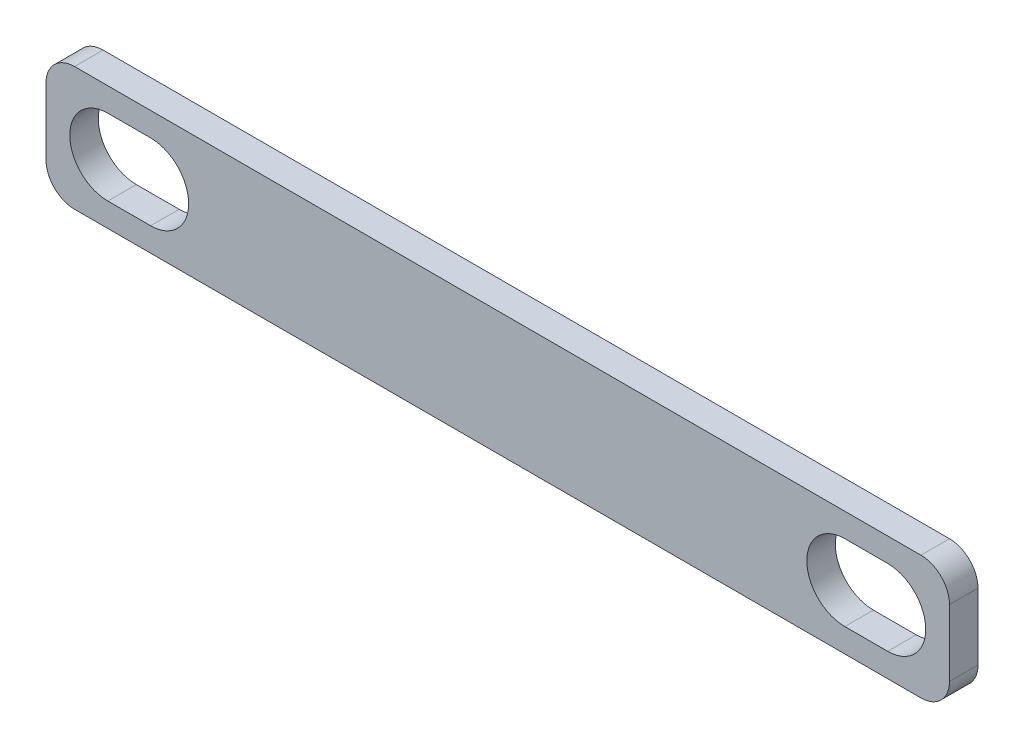
ISO-10303-21;
HEADER;
FILE_DESCRIPTION(('STEP AP214'),'2;1');
FILE_NAME('part.step','',(''),(''),'','','');
FILE_SCHEMA(('AUTOMOTIVE_DESIGN { 1 0 10303 214 1 1 1 1 }'));
ENDSEC;
DATA;
#1=APPLICATION_CONTEXT('core data for automotive mechanical design processes');
#2=APPLICATION_PROTOCOL_DEFINITION('international standard','automotive_design',2000,#1);
#3=PRODUCT_CONTEXT('',#1,'mechanical');
#4=PRODUCT('Part','Part','',(#3));
#5=PRODUCT_RELATED_PRODUCT_CATEGORY('part','',(#4));
#6=PRODUCT_DEFINITION_FORMATION('','',#4);
#7=PRODUCT_DEFINITION_CONTEXT('part definition',#1,'design');
#8=PRODUCT_DEFINITION('design','',#6,#7);
#9=PRODUCT_DEFINITION_SHAPE('','',#8);
#10=(LENGTH_UNIT() NAMED_UNIT(*) SI_UNIT(.MILLI.,.METRE.));
#11=(NAMED_UNIT(*) PLANE_ANGLE_UNIT() SI_UNIT($,.RADIAN.));
#12=(NAMED_UNIT(*) SI_UNIT($,.STERADIAN.) SOLID_ANGLE_UNIT());
#13=UNCERTAINTY_MEASURE_WITH_UNIT(LENGTH_MEASURE(1.E-05),#10,'distance_accuracy_value','');
#14=(GEOMETRIC_REPRESENTATION_CONTEXT(3) GLOBAL_UNCERTAINTY_ASSIGNED_CONTEXT((#13)) GLOBAL_UNIT_ASSIGNED_CONTEXT((#10,
#11,#12)) REPRESENTATION_CONTEXT('',''));
#15=CARTESIAN_POINT('',(0.,0.,0.));
#16=DIRECTION('',(0.,0.,1.));
#17=DIRECTION('',(1.,0.,0.));
#18=AXIS2_PLACEMENT_3D('',#15,#16,#17);
#19=CARTESIAN_POINT('',(0.,0.,3.));
#20=DIRECTION('',(0.,0.,1.));
#21=DIRECTION('',(1.,0.,0.));
#22=AXIS2_PLACEMENT_3D('',#19,#20,#21);
#23=PLANE('',#22);
#24=DIRECTION('',(0.,-1.,0.));
#25=VECTOR('',#24,1.);
#26=CARTESIAN_POINT('',(-47.5,6.5,3.));
#27=LINE('',#26,#25);
#28=CARTESIAN_POINT('',(-47.5,3.5,3.));
#29=VERTEX_POINT('',#28);
#30=CARTESIAN_POINT('',(-47.5,-3.5,3.));
#31=VERTEX_POINT('',#30);
#32=EDGE_CURVE('E202',#29,#31,#27,.T.);
#33=ORIENTED_EDGE('',*,*,#32,.T.);
#34=CARTESIAN_POINT('',(-44.5,-3.5,3.));
#35=DIRECTION('',(0.,0.,1.));
#36=DIRECTION('',(1.,0.,0.));
#37=AXIS2_PLACEMENT_3D('',#34,#35,#36);
#38=CIRCLE('',#37,3.);
#39=CARTESIAN_POINT('',(-44.5,-6.5,3.));
#40=VERTEX_POINT('',#39);
#41=EDGE_CURVE('E260',#31,#40,#38,.T.);
#42=ORIENTED_EDGE('',*,*,#41,.T.);
#43=DIRECTION('',(1.,0.,0.));
#44=VECTOR('',#43,1.);
#45=CARTESIAN_POINT('',(-47.5,-6.5,3.));
#46=LINE('',#45,#44);
#47=CARTESIAN_POINT('',(44.5,-6.5,3.));
#48=VERTEX_POINT('',#47);
#49=EDGE_CURVE('E206',#40,#48,#46,.T.);
#50=ORIENTED_EDGE('',*,*,#49,.T.);
#51=CARTESIAN_POINT('',(44.5,-3.5,3.));
#52=DIRECTION('',(0.,0.,1.));
#53=DIRECTION('',(1.,0.,0.));
#54=AXIS2_PLACEMENT_3D('',#51,#52,#53);
#55=CIRCLE('',#54,3.);
#56=CARTESIAN_POINT('',(47.5,-3.5,3.));
#57=VERTEX_POINT('',#56);
#58=EDGE_CURVE('E254',#48,#57,#55,.T.);
#59=ORIENTED_EDGE('',*,*,#58,.T.);
#60=DIRECTION('',(0.,1.,0.));
#61=VECTOR('',#60,1.);
#62=CARTESIAN_POINT('',(47.5,6.5,3.));
#63=LINE('',#62,#61);
#64=CARTESIAN_POINT('',(47.5,3.5,3.));
#65=VERTEX_POINT('',#64);
#66=EDGE_CURVE('E193',#57,#65,#63,.T.);
#67=ORIENTED_EDGE('',*,*,#66,.T.);
#68=CARTESIAN_POINT('',(44.5,3.5,3.));
#69=DIRECTION('',(0.,0.,1.));
#70=DIRECTION('',(1.,0.,0.));
#71=AXIS2_PLACEMENT_3D('',#68,#69,#70);
#72=CIRCLE('',#71,3.);
#73=CARTESIAN_POINT('',(44.5,6.5,3.));
#74=VERTEX_POINT('',#73);
#75=EDGE_CURVE('E251',#65,#74,#72,.T.);
#76=ORIENTED_EDGE('',*,*,#75,.T.);
#77=DIRECTION('',(-1.,0.,0.));
#78=VECTOR('',#77,1.);
#79=CARTESIAN_POINT('',(-47.5,6.5,3.));
#80=LINE('',#79,#78);
#81=CARTESIAN_POINT('',(-44.5,6.5,3.));
#82=VERTEX_POINT('',#81);
#83=EDGE_CURVE('E197',#74,#82,#80,.T.);
#84=ORIENTED_EDGE('',*,*,#83,.T.);
#85=CARTESIAN_POINT('',(-44.5,3.5,3.));
#86=DIRECTION('',(0.,0.,1.));
#87=DIRECTION('',(1.,0.,0.));
#88=AXIS2_PLACEMENT_3D('',#85,#86,#87);
#89=CIRCLE('',#88,3.);
#90=EDGE_CURVE('E257',#82,#29,#89,.T.);
#91=ORIENTED_EDGE('',*,*,#90,.T.);
#92=EDGE_LOOP('',(#33,#42,#50,#59,#67,#76,#84,#91));
#93=FACE_BOUND('',#92,.T.);
#94=CARTESIAN_POINT('',(41.,0.,3.));
#95=DIRECTION('',(0.,0.,1.));
#96=DIRECTION('',(1.,0.,0.));
#97=AXIS2_PLACEMENT_3D('',#94,#95,#96);
#98=CIRCLE('',#97,4.);
#99=CARTESIAN_POINT('',(41.,-4.,3.));
#100=VERTEX_POINT('',#99);
#101=CARTESIAN_POINT('',(41.,4.,3.));
#102=VERTEX_POINT('',#101);
#103=EDGE_CURVE('E182',#100,#102,#98,.T.);
#104=ORIENTED_EDGE('',*,*,#103,.F.);
#105=DIRECTION('',(-1.,0.,0.));
#106=VECTOR('',#105,1.);
#107=CARTESIAN_POINT('',(41.,-4.,3.));
#108=LINE('',#107,#106);
#109=CARTESIAN_POINT('',(36.5,-4.,3.));
#110=VERTEX_POINT('',#109);
#111=EDGE_CURVE('E438',#100,#110,#108,.T.);
#112=ORIENTED_EDGE('',*,*,#111,.T.);
#113=CARTESIAN_POINT('',(36.5,0.,3.));
#114=DIRECTION('',(0.,0.,1.));
#115=DIRECTION('',(1.,0.,0.));
#116=AXIS2_PLACEMENT_3D('',#113,#114,#115);
#117=CIRCLE('',#116,4.);
#118=CARTESIAN_POINT('',(36.5,4.,3.));
#119=VERTEX_POINT('',#118);
#120=EDGE_CURVE('E176',#119,#110,#117,.T.);
#121=ORIENTED_EDGE('',*,*,#120,.F.);
#122=DIRECTION('',(1.,0.,0.));
#123=VECTOR('',#122,1.);
#124=CARTESIAN_POINT('',(36.5,4.,3.));
#125=LINE('',#124,#123);
#126=EDGE_CURVE('E55',#119,#102,#125,.T.);
#127=ORIENTED_EDGE('',*,*,#126,.T.);
#128=EDGE_LOOP('',(#104,#112,#121,#127));
#129=FACE_BOUND('',#128,.T.);
#130=CARTESIAN_POINT('',(-36.5,0.,3.));
#131=DIRECTION('',(0.,0.,1.));
#132=DIRECTION('',(1.,0.,0.));
#133=AXIS2_PLACEMENT_3D('',#130,#131,#132);
#134=CIRCLE('',#133,4.);
#135=CARTESIAN_POINT('',(-36.5,-4.,3.));
#136=VERTEX_POINT('',#135);
#137=CARTESIAN_POINT('',(-36.5,4.,3.));
#138=VERTEX_POINT('',#137);
#139=EDGE_CURVE('E466',#136,#138,#134,.T.);
#140=ORIENTED_EDGE('',*,*,#139,.F.);
#141=DIRECTION('',(-1.,0.,0.));
#142=VECTOR('',#141,1.);
#143=CARTESIAN_POINT('',(-36.5,-4.,3.));
#144=LINE('',#143,#142);
#145=CARTESIAN_POINT('',(-41.,-4.,3.));
#146=VERTEX_POINT('',#145);
#147=EDGE_CURVE('E446',#136,#146,#144,.T.);
#148=ORIENTED_EDGE('',*,*,#147,.T.);
#149=CARTESIAN_POINT('',(-41.,0.,3.));
#150=DIRECTION('',(0.,0.,1.));
#151=DIRECTION('',(1.,0.,0.));
#152=AXIS2_PLACEMENT_3D('',#149,#150,#151);
#153=CIRCLE('',#152,4.);
#154=CARTESIAN_POINT('',(-41.,4.,3.));
#155=VERTEX_POINT('',#154);
#156=EDGE_CURVE('E174',#155,#146,#153,.T.);
#157=ORIENTED_EDGE('',*,*,#156,.F.);
#158=DIRECTION('',(1.,0.,0.));
#159=VECTOR('',#158,1.);
#160=CARTESIAN_POINT('',(-41.,4.,3.));
#161=LINE('',#160,#159);
#162=EDGE_CURVE('E165',#155,#138,#161,.T.);
#163=ORIENTED_EDGE('',*,*,#162,.T.);
#164=EDGE_LOOP('',(#140,#148,#157,#163));
#165=FACE_BOUND('',#164,.T.);
#166=ADVANCED_FACE('F39',(#93,#129,#165),#23,.T.);
#167=CARTESIAN_POINT('',(0.,0.,0.));
#168=DIRECTION('',(0.,0.,1.));
#169=DIRECTION('',(1.,0.,0.));
#170=AXIS2_PLACEMENT_3D('',#167,#168,#169);
#171=PLANE('',#170);
#172=DIRECTION('',(1.,0.,0.));
#173=VECTOR('',#172,1.);
#174=CARTESIAN_POINT('',(-47.5,-6.5,0.));
#175=LINE('',#174,#173);
#176=CARTESIAN_POINT('',(-44.5,-6.5,0.));
#177=VERTEX_POINT('',#176);
#178=CARTESIAN_POINT('',(44.5,-6.5,0.));
#179=VERTEX_POINT('',#178);
#180=EDGE_CURVE('E198',#177,#179,#175,.T.);
#181=ORIENTED_EDGE('',*,*,#180,.F.);
#182=CARTESIAN_POINT('',(-44.5,-3.5,0.));
#183=DIRECTION('',(0.,0.,1.));
#184=DIRECTION('',(1.,0.,0.));
#185=AXIS2_PLACEMENT_3D('',#182,#183,#184);
#186=CIRCLE('',#185,3.);
#187=CARTESIAN_POINT('',(-47.5,-3.5,0.));
#188=VERTEX_POINT('',#187);
#189=EDGE_CURVE('E241',#177,#188,#186,.F.);
#190=ORIENTED_EDGE('',*,*,#189,.T.);
#191=DIRECTION('',(0.,-1.,0.));
#192=VECTOR('',#191,1.);
#193=CARTESIAN_POINT('',(-47.5,6.5,0.));
#194=LINE('',#193,#192);
#195=CARTESIAN_POINT('',(-47.5,3.5,0.));
#196=VERTEX_POINT('',#195);
#197=EDGE_CURVE('E219',#196,#188,#194,.T.);
#198=ORIENTED_EDGE('',*,*,#197,.F.);
#199=CARTESIAN_POINT('',(-44.5,3.5,0.));
#200=DIRECTION('',(0.,0.,1.));
#201=DIRECTION('',(1.,0.,0.));
#202=AXIS2_PLACEMENT_3D('',#199,#200,#201);
#203=CIRCLE('',#202,3.);
#204=CARTESIAN_POINT('',(-44.5,6.5,0.));
#205=VERTEX_POINT('',#204);
#206=EDGE_CURVE('E238',#196,#205,#203,.F.);
#207=ORIENTED_EDGE('',*,*,#206,.T.);
#208=DIRECTION('',(-1.,0.,0.));
#209=VECTOR('',#208,1.);
#210=CARTESIAN_POINT('',(-47.5,6.5,0.));
#211=LINE('',#210,#209);
#212=CARTESIAN_POINT('',(44.5,6.5,0.));
#213=VERTEX_POINT('',#212);
#214=EDGE_CURVE('E215',#213,#205,#211,.T.);
#215=ORIENTED_EDGE('',*,*,#214,.F.);
#216=CARTESIAN_POINT('',(44.5,3.5,0.));
#217=DIRECTION('',(0.,0.,1.));
#218=DIRECTION('',(1.,0.,0.));
#219=AXIS2_PLACEMENT_3D('',#216,#217,#218);
#220=CIRCLE('',#219,3.);
#221=CARTESIAN_POINT('',(47.5,3.5,0.));
#222=VERTEX_POINT('',#221);
#223=EDGE_CURVE('E232',#213,#222,#220,.F.);
#224=ORIENTED_EDGE('',*,*,#223,.T.);
#225=DIRECTION('',(0.,1.,0.));
#226=VECTOR('',#225,1.);
#227=CARTESIAN_POINT('',(47.5,6.5,0.));
#228=LINE('',#227,#226);
#229=CARTESIAN_POINT('',(47.5,-3.5,0.));
#230=VERTEX_POINT('',#229);
#231=EDGE_CURVE('E211',#230,#222,#228,.T.);
#232=ORIENTED_EDGE('',*,*,#231,.F.);
#233=CARTESIAN_POINT('',(44.5,-3.5,0.));
#234=DIRECTION('',(0.,0.,1.));
#235=DIRECTION('',(1.,0.,0.));
#236=AXIS2_PLACEMENT_3D('',#233,#234,#235);
#237=CIRCLE('',#236,3.);
#238=EDGE_CURVE('E235',#230,#179,#237,.F.);
#239=ORIENTED_EDGE('',*,*,#238,.T.);
#240=EDGE_LOOP('',(#181,#190,#198,#207,#215,#224,#232,#239));
#241=FACE_BOUND('',#240,.T.);
#242=DIRECTION('',(-1.,0.,0.));
#243=VECTOR('',#242,1.);
#244=CARTESIAN_POINT('',(41.,-4.,0.));
#245=LINE('',#244,#243);
#246=CARTESIAN_POINT('',(41.,-4.,0.));
#247=VERTEX_POINT('',#246);
#248=CARTESIAN_POINT('',(36.5,-3.99999999999999,0.));
#249=VERTEX_POINT('',#248);
#250=EDGE_CURVE('E63',#247,#249,#245,.T.);
#251=ORIENTED_EDGE('',*,*,#250,.F.);
#252=CARTESIAN_POINT('',(41.,0.,0.));
#253=DIRECTION('',(0.,0.,1.));
#254=DIRECTION('',(1.,0.,0.));
#255=AXIS2_PLACEMENT_3D('',#252,#253,#254);
#256=CIRCLE('',#255,4.);
#257=CARTESIAN_POINT('',(41.,4.,0.));
#258=VERTEX_POINT('',#257);
#259=EDGE_CURVE('E187',#247,#258,#256,.T.);
#260=ORIENTED_EDGE('',*,*,#259,.T.);
#261=DIRECTION('',(1.,0.,0.));
#262=VECTOR('',#261,1.);
#263=CARTESIAN_POINT('',(36.5,4.,0.));
#264=LINE('',#263,#262);
#265=CARTESIAN_POINT('',(36.5,4.,0.));
#266=VERTEX_POINT('',#265);
#267=EDGE_CURVE('E452',#266,#258,#264,.T.);
#268=ORIENTED_EDGE('',*,*,#267,.F.);
#269=CARTESIAN_POINT('',(36.5,0.,0.));
#270=DIRECTION('',(0.,0.,1.));
#271=DIRECTION('',(1.,0.,0.));
#272=AXIS2_PLACEMENT_3D('',#269,#270,#271);
#273=CIRCLE('',#272,4.);
#274=EDGE_CURVE('E470',#266,#249,#273,.T.);
#275=ORIENTED_EDGE('',*,*,#274,.T.);
#276=EDGE_LOOP('',(#251,#260,#268,#275));
#277=FACE_BOUND('',#276,.T.);
#278=DIRECTION('',(-1.,0.,0.));
#279=VECTOR('',#278,1.);
#280=CARTESIAN_POINT('',(-36.5,-4.,0.));
#281=LINE('',#280,#279);
#282=CARTESIAN_POINT('',(-36.5,-4.,0.));
#283=VERTEX_POINT('',#282);
#284=CARTESIAN_POINT('',(-41.,-4.,0.));
#285=VERTEX_POINT('',#284);
#286=EDGE_CURVE('E152',#283,#285,#281,.T.);
#287=ORIENTED_EDGE('',*,*,#286,.F.);
#288=CARTESIAN_POINT('',(-36.5,0.,0.));
#289=DIRECTION('',(0.,0.,1.));
#290=DIRECTION('',(1.,0.,0.));
#291=AXIS2_PLACEMENT_3D('',#288,#289,#290);
#292=CIRCLE('',#291,4.);
#293=CARTESIAN_POINT('',(-36.5,3.99999999999999,0.));
#294=VERTEX_POINT('',#293);
#295=EDGE_CURVE('E189',#283,#294,#292,.T.);
#296=ORIENTED_EDGE('',*,*,#295,.T.);
#297=DIRECTION('',(1.,0.,0.));
#298=VECTOR('',#297,1.);
#299=CARTESIAN_POINT('',(-41.,4.,0.));
#300=LINE('',#299,#298);
#301=CARTESIAN_POINT('',(-41.,4.,0.));
#302=VERTEX_POINT('',#301);
#303=EDGE_CURVE('E164',#302,#294,#300,.T.);
#304=ORIENTED_EDGE('',*,*,#303,.F.);
#305=CARTESIAN_POINT('',(-41.,0.,0.));
#306=DIRECTION('',(0.,0.,1.));
#307=DIRECTION('',(1.,0.,0.));
#308=AXIS2_PLACEMENT_3D('',#305,#306,#307);
#309=CIRCLE('',#308,4.);
#310=EDGE_CURVE('E172',#302,#285,#309,.T.);
#311=ORIENTED_EDGE('',*,*,#310,.T.);
#312=EDGE_LOOP('',(#287,#296,#304,#311));
#313=FACE_BOUND('',#312,.T.);
#314=ADVANCED_FACE('F180',(#241,#277,#313),#171,.F.);
#315=CARTESIAN_POINT('',(-41.,0.,0.));
#316=DIRECTION('',(0.,0.,1.));
#317=DIRECTION('',(1.,0.,0.));
#318=AXIS2_PLACEMENT_3D('',#315,#316,#317);
#319=CYLINDRICAL_SURFACE('',#318,4.);
#320=DIRECTION('',(0.,0.,1.));
#321=VECTOR('',#320,1.);
#322=CARTESIAN_POINT('',(-41.,-4.,0.));
#323=LINE('',#322,#321);
#324=EDGE_CURVE('E155',#285,#146,#323,.T.);
#325=ORIENTED_EDGE('',*,*,#324,.F.);
#326=ORIENTED_EDGE('',*,*,#310,.F.);
#327=DIRECTION('',(0.,0.,1.));
#328=VECTOR('',#327,1.);
#329=CARTESIAN_POINT('',(-41.,4.,0.));
#330=LINE('',#329,#328);
#331=EDGE_CURVE('E177',#302,#155,#330,.T.);
#332=ORIENTED_EDGE('',*,*,#331,.T.);
#333=ORIENTED_EDGE('',*,*,#156,.T.);
#334=EDGE_LOOP('',(#325,#326,#332,#333));
#335=FACE_BOUND('',#334,.T.);
#336=ADVANCED_FACE('F170',(#335),#319,.F.);
#337=CARTESIAN_POINT('',(41.,0.,0.));
#338=DIRECTION('',(0.,0.,1.));
#339=DIRECTION('',(1.,0.,0.));
#340=AXIS2_PLACEMENT_3D('',#337,#338,#339);
#341=CYLINDRICAL_SURFACE('',#340,4.);
#342=DIRECTION('',(0.,0.,1.));
#343=VECTOR('',#342,1.);
#344=CARTESIAN_POINT('',(41.,-4.,0.));
#345=LINE('',#344,#343);
#346=EDGE_CURVE('E440',#247,#100,#345,.T.);
#347=ORIENTED_EDGE('',*,*,#346,.T.);
#348=ORIENTED_EDGE('',*,*,#103,.T.);
#349=DIRECTION('',(0.,0.,1.));
#350=VECTOR('',#349,1.);
#351=CARTESIAN_POINT('',(41.,4.,0.));
#352=LINE('',#351,#350);
#353=EDGE_CURVE('E453',#258,#102,#352,.T.);
#354=ORIENTED_EDGE('',*,*,#353,.F.);
#355=ORIENTED_EDGE('',*,*,#259,.F.);
#356=EDGE_LOOP('',(#347,#348,#354,#355));
#357=FACE_BOUND('',#356,.T.);
#358=ADVANCED_FACE('F375',(#357),#341,.F.);
#359=CARTESIAN_POINT('',(36.5,0.,0.));
#360=DIRECTION('',(0.,0.,1.));
#361=DIRECTION('',(1.,0.,0.));
#362=AXIS2_PLACEMENT_3D('',#359,#360,#361);
#363=CYLINDRICAL_SURFACE('',#362,4.);
#364=DIRECTION('',(0.,0.,1.));
#365=VECTOR('',#364,1.);
#366=CARTESIAN_POINT('',(36.5,-4.,0.));
#367=LINE('',#366,#365);
#368=EDGE_CURVE('E441',#249,#110,#367,.T.);
#369=ORIENTED_EDGE('',*,*,#368,.F.);
#370=ORIENTED_EDGE('',*,*,#274,.F.);
#371=DIRECTION('',(0.,0.,1.));
#372=VECTOR('',#371,1.);
#373=CARTESIAN_POINT('',(36.5,4.,0.));
#374=LINE('',#373,#372);
#375=EDGE_CURVE('E478',#266,#119,#374,.T.);
#376=ORIENTED_EDGE('',*,*,#375,.T.);
#377=ORIENTED_EDGE('',*,*,#120,.T.);
#378=EDGE_LOOP('',(#369,#370,#376,#377));
#379=FACE_BOUND('',#378,.T.);
#380=ADVANCED_FACE('F383',(#379),#363,.F.);
#381=CARTESIAN_POINT('',(-36.5,0.,0.));
#382=DIRECTION('',(0.,0.,1.));
#383=DIRECTION('',(1.,0.,0.));
#384=AXIS2_PLACEMENT_3D('',#381,#382,#383);
#385=CYLINDRICAL_SURFACE('',#384,4.);
#386=DIRECTION('',(0.,0.,1.));
#387=VECTOR('',#386,1.);
#388=CARTESIAN_POINT('',(-36.5,-4.,0.));
#389=LINE('',#388,#387);
#390=EDGE_CURVE('E158',#283,#136,#389,.T.);
#391=ORIENTED_EDGE('',*,*,#390,.T.);
#392=ORIENTED_EDGE('',*,*,#139,.T.);
#393=DIRECTION('',(0.,0.,1.));
#394=VECTOR('',#393,1.);
#395=CARTESIAN_POINT('',(-36.5,4.,0.));
#396=LINE('',#395,#394);
#397=EDGE_CURVE('E487',#294,#138,#396,.T.);
#398=ORIENTED_EDGE('',*,*,#397,.F.);
#399=ORIENTED_EDGE('',*,*,#295,.F.);
#400=EDGE_LOOP('',(#391,#392,#398,#399));
#401=FACE_BOUND('',#400,.T.);
#402=ADVANCED_FACE('F333',(#401),#385,.F.);
#403=CARTESIAN_POINT('',(47.5,6.5,3.));
#404=DIRECTION('',(-1.,0.,0.));
#405=DIRECTION('',(0.,0.,1.));
#406=AXIS2_PLACEMENT_3D('',#403,#404,#405);
#407=PLANE('',#406);
#408=ORIENTED_EDGE('',*,*,#66,.F.);
#409=DIRECTION('',(0.,0.,-1.));
#410=VECTOR('',#409,1.);
#411=CARTESIAN_POINT('',(47.5,-3.5,3.));
#412=LINE('',#411,#410);
#413=EDGE_CURVE('E11',#57,#230,#412,.T.);
#414=ORIENTED_EDGE('',*,*,#413,.T.);
#415=ORIENTED_EDGE('',*,*,#231,.T.);
#416=DIRECTION('',(0.,0.,-1.));
#417=VECTOR('',#416,1.);
#418=CARTESIAN_POINT('',(47.5,3.5,3.));
#419=LINE('',#418,#417);
#420=EDGE_CURVE('E48',#222,#65,#419,.F.);
#421=ORIENTED_EDGE('',*,*,#420,.T.);
#422=EDGE_LOOP('',(#408,#414,#415,#421));
#423=FACE_BOUND('',#422,.T.);
#424=ADVANCED_FACE('F273',(#423),#407,.F.);
#425=CARTESIAN_POINT('',(-47.5,6.5,3.));
#426=DIRECTION('',(0.,-1.,0.));
#427=DIRECTION('',(0.,0.,-1.));
#428=AXIS2_PLACEMENT_3D('',#425,#426,#427);
#429=PLANE('',#428);
#430=ORIENTED_EDGE('',*,*,#214,.T.);
#431=DIRECTION('',(0.,0.,-1.));
#432=VECTOR('',#431,1.);
#433=CARTESIAN_POINT('',(-44.5,6.5,3.));
#434=LINE('',#433,#432);
#435=EDGE_CURVE('E267',#205,#82,#434,.F.);
#436=ORIENTED_EDGE('',*,*,#435,.T.);
#437=ORIENTED_EDGE('',*,*,#83,.F.);
#438=DIRECTION('',(0.,0.,-1.));
#439=VECTOR('',#438,1.);
#440=CARTESIAN_POINT('',(44.5,6.5,3.));
#441=LINE('',#440,#439);
#442=EDGE_CURVE('E263',#74,#213,#441,.T.);
#443=ORIENTED_EDGE('',*,*,#442,.T.);
#444=EDGE_LOOP('',(#430,#436,#437,#443));
#445=FACE_BOUND('',#444,.T.);
#446=ADVANCED_FACE('F285',(#445),#429,.F.);
#447=CARTESIAN_POINT('',(-47.5,6.5,3.));
#448=DIRECTION('',(1.,0.,0.));
#449=DIRECTION('',(0.,0.,-1.));
#450=AXIS2_PLACEMENT_3D('',#447,#448,#449);
#451=PLANE('',#450);
#452=ORIENTED_EDGE('',*,*,#197,.T.);
#453=DIRECTION('',(0.,0.,-1.));
#454=VECTOR('',#453,1.);
#455=CARTESIAN_POINT('',(-47.5,-3.5,3.));
#456=LINE('',#455,#454);
#457=EDGE_CURVE('E248',#188,#31,#456,.F.);
#458=ORIENTED_EDGE('',*,*,#457,.T.);
#459=ORIENTED_EDGE('',*,*,#32,.F.);
#460=DIRECTION('',(0.,0.,-1.));
#461=VECTOR('',#460,1.);
#462=CARTESIAN_POINT('',(-47.5,3.5,3.));
#463=LINE('',#462,#461);
#464=EDGE_CURVE('E244',#29,#196,#463,.T.);
#465=ORIENTED_EDGE('',*,*,#464,.T.);
#466=EDGE_LOOP('',(#452,#458,#459,#465));
#467=FACE_BOUND('',#466,.T.);
#468=ADVANCED_FACE('F297',(#467),#451,.F.);
#469=CARTESIAN_POINT('',(-47.5,-6.5,3.));
#470=DIRECTION('',(0.,1.,0.));
#471=DIRECTION('',(0.,0.,1.));
#472=AXIS2_PLACEMENT_3D('',#469,#470,#471);
#473=PLANE('',#472);
#474=ORIENTED_EDGE('',*,*,#49,.F.);
#475=DIRECTION('',(0.,0.,-1.));
#476=VECTOR('',#475,1.);
#477=CARTESIAN_POINT('',(-44.5,-6.5,3.));
#478=LINE('',#477,#476);
#479=EDGE_CURVE('E228',#40,#177,#478,.T.);
#480=ORIENTED_EDGE('',*,*,#479,.T.);
#481=ORIENTED_EDGE('',*,*,#180,.T.);
#482=DIRECTION('',(0.,0.,-1.));
#483=VECTOR('',#482,1.);
#484=CARTESIAN_POINT('',(44.5,-6.5,3.));
#485=LINE('',#484,#483);
#486=EDGE_CURVE('E210',#179,#48,#485,.F.);
#487=ORIENTED_EDGE('',*,*,#486,.T.);
#488=EDGE_LOOP('',(#474,#480,#481,#487));
#489=FACE_BOUND('',#488,.T.);
#490=ADVANCED_FACE('F305',(#489),#473,.F.);
#491=CARTESIAN_POINT('',(-44.5,-3.5,3.));
#492=DIRECTION('',(0.,0.,-1.));
#493=DIRECTION('',(-1.,0.,0.));
#494=AXIS2_PLACEMENT_3D('',#491,#492,#493);
#495=CYLINDRICAL_SURFACE('',#494,3.);
#496=ORIENTED_EDGE('',*,*,#41,.F.);
#497=ORIENTED_EDGE('',*,*,#457,.F.);
#498=ORIENTED_EDGE('',*,*,#189,.F.);
#499=ORIENTED_EDGE('',*,*,#479,.F.);
#500=EDGE_LOOP('',(#496,#497,#498,#499));
#501=FACE_BOUND('',#500,.T.);
#502=ADVANCED_FACE('F303',(#501),#495,.T.);
#503=CARTESIAN_POINT('',(-44.5,3.5,3.));
#504=DIRECTION('',(0.,0.,-1.));
#505=DIRECTION('',(-1.,0.,0.));
#506=AXIS2_PLACEMENT_3D('',#503,#504,#505);
#507=CYLINDRICAL_SURFACE('',#506,3.);
#508=ORIENTED_EDGE('',*,*,#90,.F.);
#509=ORIENTED_EDGE('',*,*,#435,.F.);
#510=ORIENTED_EDGE('',*,*,#206,.F.);
#511=ORIENTED_EDGE('',*,*,#464,.F.);
#512=EDGE_LOOP('',(#508,#509,#510,#511));
#513=FACE_BOUND('',#512,.T.);
#514=ADVANCED_FACE('F294',(#513),#507,.T.);
#515=CARTESIAN_POINT('',(44.5,-3.5,3.));
#516=DIRECTION('',(0.,0.,-1.));
#517=DIRECTION('',(-1.,0.,0.));
#518=AXIS2_PLACEMENT_3D('',#515,#516,#517);
#519=CYLINDRICAL_SURFACE('',#518,3.);
#520=ORIENTED_EDGE('',*,*,#58,.F.);
#521=ORIENTED_EDGE('',*,*,#486,.F.);
#522=ORIENTED_EDGE('',*,*,#238,.F.);
#523=ORIENTED_EDGE('',*,*,#413,.F.);
#524=EDGE_LOOP('',(#520,#521,#522,#523));
#525=FACE_BOUND('',#524,.T.);
#526=ADVANCED_FACE('F308',(#525),#519,.T.);
#527=CARTESIAN_POINT('',(44.5,3.5,3.));
#528=DIRECTION('',(0.,0.,-1.));
#529=DIRECTION('',(-1.,0.,0.));
#530=AXIS2_PLACEMENT_3D('',#527,#528,#529);
#531=CYLINDRICAL_SURFACE('',#530,3.);
#532=ORIENTED_EDGE('',*,*,#75,.F.);
#533=ORIENTED_EDGE('',*,*,#420,.F.);
#534=ORIENTED_EDGE('',*,*,#223,.F.);
#535=ORIENTED_EDGE('',*,*,#442,.F.);
#536=EDGE_LOOP('',(#532,#533,#534,#535));
#537=FACE_BOUND('',#536,.T.);
#538=ADVANCED_FACE('F41',(#537),#531,.T.);
#539=CARTESIAN_POINT('',(-41.,4.,0.));
#540=DIRECTION('',(0.,-1.,0.));
#541=DIRECTION('',(0.,0.,-1.));
#542=AXIS2_PLACEMENT_3D('',#539,#540,#541);
#543=PLANE('',#542);
#544=ORIENTED_EDGE('',*,*,#162,.F.);
#545=ORIENTED_EDGE('',*,*,#331,.F.);
#546=ORIENTED_EDGE('',*,*,#303,.T.);
#547=ORIENTED_EDGE('',*,*,#397,.T.);
#548=EDGE_LOOP('',(#544,#545,#546,#547));
#549=FACE_BOUND('',#548,.T.);
#550=ADVANCED_FACE('F314',(#549),#543,.T.);
#551=CARTESIAN_POINT('',(-36.5,-4.,0.));
#552=DIRECTION('',(0.,1.,0.));
#553=DIRECTION('',(0.,0.,1.));
#554=AXIS2_PLACEMENT_3D('',#551,#552,#553);
#555=PLANE('',#554);
#556=ORIENTED_EDGE('',*,*,#147,.F.);
#557=ORIENTED_EDGE('',*,*,#390,.F.);
#558=ORIENTED_EDGE('',*,*,#286,.T.);
#559=ORIENTED_EDGE('',*,*,#324,.T.);
#560=EDGE_LOOP('',(#556,#557,#558,#559));
#561=FACE_BOUND('',#560,.T.);
#562=ADVANCED_FACE('F154',(#561),#555,.T.);
#563=CARTESIAN_POINT('',(36.5,4.,0.));
#564=DIRECTION('',(0.,-1.,0.));
#565=DIRECTION('',(0.,0.,-1.));
#566=AXIS2_PLACEMENT_3D('',#563,#564,#565);
#567=PLANE('',#566);
#568=ORIENTED_EDGE('',*,*,#126,.F.);
#569=ORIENTED_EDGE('',*,*,#375,.F.);
#570=ORIENTED_EDGE('',*,*,#267,.T.);
#571=ORIENTED_EDGE('',*,*,#353,.T.);
#572=EDGE_LOOP('',(#568,#569,#570,#571));
#573=FACE_BOUND('',#572,.T.);
#574=ADVANCED_FACE('F416',(#573),#567,.T.);
#575=CARTESIAN_POINT('',(41.,-4.,0.));
#576=DIRECTION('',(0.,1.,0.));
#577=DIRECTION('',(0.,0.,1.));
#578=AXIS2_PLACEMENT_3D('',#575,#576,#577);
#579=PLANE('',#578);
#580=ORIENTED_EDGE('',*,*,#111,.F.);
#581=ORIENTED_EDGE('',*,*,#346,.F.);
#582=ORIENTED_EDGE('',*,*,#250,.T.);
#583=ORIENTED_EDGE('',*,*,#368,.T.);
#584=EDGE_LOOP('',(#580,#581,#582,#583));
#585=FACE_BOUND('',#584,.T.);
#586=ADVANCED_FACE('F425',(#585),#579,.T.);
#587=CLOSED_SHELL('',(#166,#314,#336,#358,#380,#402,#424,#446,#468,#490,#502,#514,#526,#538,
#550,#562,#574,#586));
#588=MANIFOLD_SOLID_BREP('B2',#587);
#589=ADVANCED_BREP_SHAPE_REPRESENTATION('',(#18,#588),#14);
#590=SHAPE_DEFINITION_REPRESENTATION(#9,#589);
ENDSEC;
END-ISO-10303-21;
